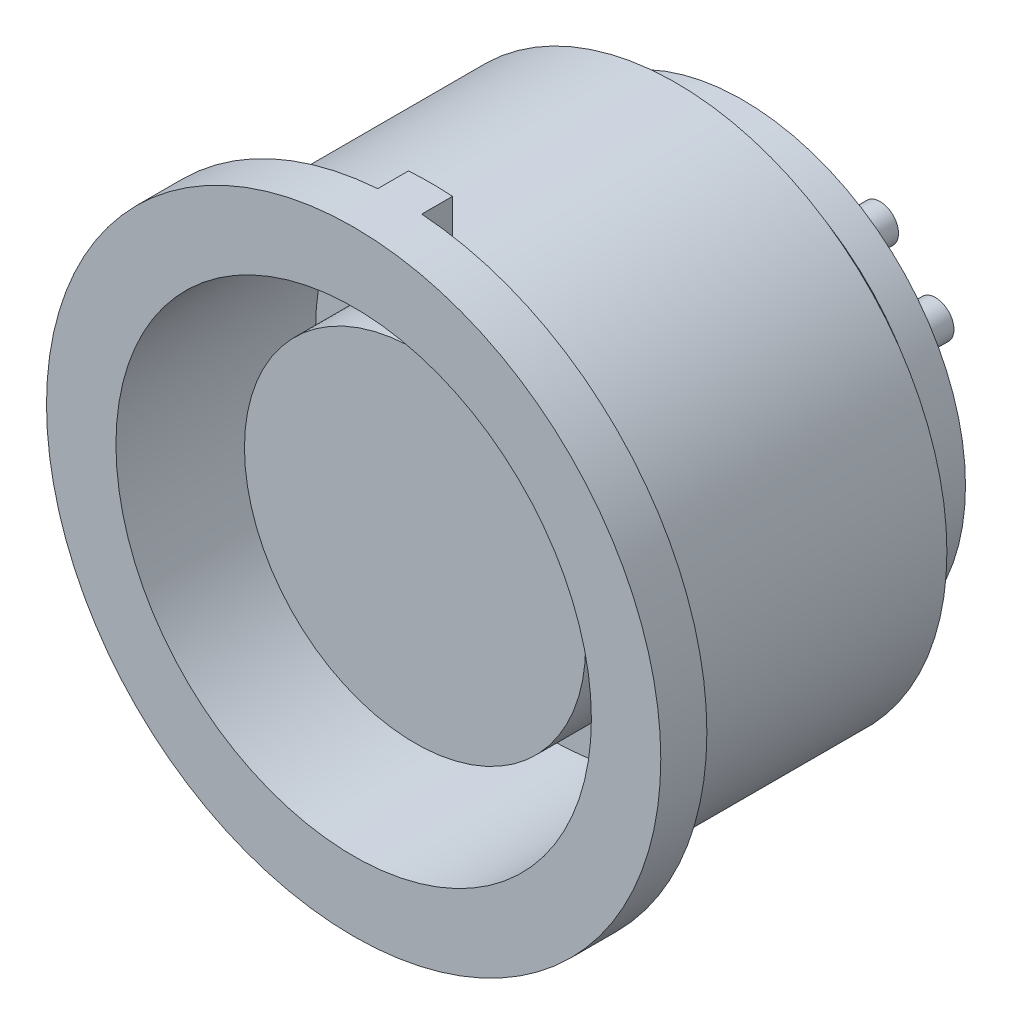
ISO-10303-21;
HEADER;
FILE_DESCRIPTION(('STEP AP214'),'2;1');
FILE_NAME('part.step','',(''),(''),'','','');
FILE_SCHEMA(('AUTOMOTIVE_DESIGN { 1 0 10303 214 1 1 1 1 }'));
ENDSEC;
DATA;
#1=APPLICATION_CONTEXT('core data for automotive mechanical design processes');
#2=APPLICATION_PROTOCOL_DEFINITION('international standard','automotive_design',2000,#1);
#3=PRODUCT_CONTEXT('',#1,'mechanical');
#4=PRODUCT('Part','Part','',(#3));
#5=PRODUCT_RELATED_PRODUCT_CATEGORY('part','',(#4));
#6=PRODUCT_DEFINITION_FORMATION('','',#4);
#7=PRODUCT_DEFINITION_CONTEXT('part definition',#1,'design');
#8=PRODUCT_DEFINITION('design','',#6,#7);
#9=PRODUCT_DEFINITION_SHAPE('','',#8);
#10=(LENGTH_UNIT() NAMED_UNIT(*) SI_UNIT(.MILLI.,.METRE.));
#11=(NAMED_UNIT(*) PLANE_ANGLE_UNIT() SI_UNIT($,.RADIAN.));
#12=(NAMED_UNIT(*) SI_UNIT($,.STERADIAN.) SOLID_ANGLE_UNIT());
#13=UNCERTAINTY_MEASURE_WITH_UNIT(LENGTH_MEASURE(1.E-05),#10,'distance_accuracy_value','');
#14=(GEOMETRIC_REPRESENTATION_CONTEXT(3) GLOBAL_UNCERTAINTY_ASSIGNED_CONTEXT((#13)) GLOBAL_UNIT_ASSIGNED_CONTEXT((#10,
#11,#12)) REPRESENTATION_CONTEXT('',''));
#15=CARTESIAN_POINT('',(0.,0.,0.));
#16=DIRECTION('',(0.,0.,1.));
#17=DIRECTION('',(1.,0.,0.));
#18=AXIS2_PLACEMENT_3D('',#15,#16,#17);
#19=CARTESIAN_POINT('',(0.,0.,11.3571428571429));
#20=DIRECTION('',(0.,0.,1.));
#21=DIRECTION('',(1.,0.,0.));
#22=AXIS2_PLACEMENT_3D('',#19,#20,#21);
#23=CYLINDRICAL_SURFACE('',#22,8.815);
#24=CARTESIAN_POINT('',(0.,0.,-9.));
#25=DIRECTION('',(0.,0.,1.));
#26=DIRECTION('',(1.,0.,0.));
#27=AXIS2_PLACEMENT_3D('',#24,#25,#26);
#28=CIRCLE('',#27,8.815);
#29=CARTESIAN_POINT('',(8.815,0.,-9.));
#30=VERTEX_POINT('',#29);
#31=EDGE_CURVE('E160',#30,#30,#28,.T.);
#32=ORIENTED_EDGE('',*,*,#31,.T.);
#33=EDGE_LOOP('',(#32));
#34=FACE_BOUND('',#33,.T.);
#35=DIRECTION('',(0.,0.,1.));
#36=VECTOR('',#35,1.);
#37=CARTESIAN_POINT('',(0.716714940094325,8.78581497043078,-1.));
#38=LINE('',#37,#36);
#39=CARTESIAN_POINT('',(0.716714940094325,8.78581497043078,-0.999999999999999));
#40=VERTEX_POINT('',#39);
#41=CARTESIAN_POINT('',(0.716714940094325,8.78581497043078,0.));
#42=VERTEX_POINT('',#41);
#43=EDGE_CURVE('E79',#40,#42,#38,.T.);
#44=ORIENTED_EDGE('',*,*,#43,.T.);
#45=CARTESIAN_POINT('',(0.,0.,0.));
#46=DIRECTION('',(0.,0.,1.));
#47=DIRECTION('',(1.,0.,0.));
#48=AXIS2_PLACEMENT_3D('',#45,#46,#47);
#49=CIRCLE('',#48,8.815);
#50=CARTESIAN_POINT('',(-0.716714940094318,8.78581497043078,0.));
#51=VERTEX_POINT('',#50);
#52=EDGE_CURVE('E135',#51,#42,#49,.T.);
#53=ORIENTED_EDGE('',*,*,#52,.F.);
#54=DIRECTION('',(0.,0.,1.));
#55=VECTOR('',#54,1.);
#56=CARTESIAN_POINT('',(-0.716714940094317,8.78581497043078,-1.));
#57=LINE('',#56,#55);
#58=CARTESIAN_POINT('',(-0.716714940094317,8.78581497043078,-0.999999999999999));
#59=VERTEX_POINT('',#58);
#60=EDGE_CURVE('E53',#59,#51,#57,.T.);
#61=ORIENTED_EDGE('',*,*,#60,.F.);
#62=CARTESIAN_POINT('',(0.,0.,-1.));
#63=DIRECTION('',(0.,0.,1.));
#64=DIRECTION('',(-1.,0.,0.));
#65=AXIS2_PLACEMENT_3D('',#62,#63,#64);
#66=CIRCLE('',#65,8.815);
#67=EDGE_CURVE('E48',#40,#59,#66,.T.);
#68=ORIENTED_EDGE('',*,*,#67,.F.);
#69=EDGE_LOOP('',(#44,#53,#61,#68));
#70=FACE_BOUND('',#69,.T.);
#71=ADVANCED_FACE('F34',(#34,#70),#23,.T.);
#72=CARTESIAN_POINT('',(0.,8.815,0.));
#73=DIRECTION('',(0.,0.,1.));
#74=DIRECTION('',(1.,0.,0.));
#75=AXIS2_PLACEMENT_3D('',#72,#73,#74);
#76=PLANE('',#75);
#77=DIRECTION('',(0.,-1.,0.));
#78=VECTOR('',#77,1.);
#79=CARTESIAN_POINT('',(0.716714940094325,9.97428291631261,0.));
#80=LINE('',#79,#78);
#81=CARTESIAN_POINT('',(0.716714940094325,9.97428291631261,0.));
#82=VERTEX_POINT('',#81);
#83=EDGE_CURVE('E244',#82,#42,#80,.T.);
#84=ORIENTED_EDGE('',*,*,#83,.F.);
#85=CARTESIAN_POINT('',(0.,0.,0.));
#86=DIRECTION('',(0.,0.,1.));
#87=DIRECTION('',(1.,0.,0.));
#88=AXIS2_PLACEMENT_3D('',#85,#86,#87);
#89=CIRCLE('',#88,10.);
#90=CARTESIAN_POINT('',(-0.716714940094318,9.97428291631261,0.));
#91=VERTEX_POINT('',#90);
#92=EDGE_CURVE('E94',#91,#82,#89,.T.);
#93=ORIENTED_EDGE('',*,*,#92,.F.);
#94=DIRECTION('',(0.,1.,0.));
#95=VECTOR('',#94,1.);
#96=CARTESIAN_POINT('',(-0.716714940094318,9.97428291631261,0.));
#97=LINE('',#96,#95);
#98=EDGE_CURVE('E90',#51,#91,#97,.T.);
#99=ORIENTED_EDGE('',*,*,#98,.F.);
#100=ORIENTED_EDGE('',*,*,#52,.T.);
#101=EDGE_LOOP('',(#84,#93,#99,#100));
#102=FACE_BOUND('',#101,.T.);
#103=ADVANCED_FACE('F233',(#102),#76,.F.);
#104=CARTESIAN_POINT('',(0.,0.,-10.1308491942857));
#105=DIRECTION('',(0.,0.,1.));
#106=DIRECTION('',(1.,0.,0.));
#107=AXIS2_PLACEMENT_3D('',#104,#105,#106);
#108=CONICAL_SURFACE('',#107,7.25,0.945071369421413);
#109=ORIENTED_EDGE('',*,*,#31,.F.);
#110=EDGE_LOOP('',(#109));
#111=FACE_BOUND('',#110,.T.);
#112=CARTESIAN_POINT('',(0.,0.,-10.1308491942857));
#113=DIRECTION('',(0.,0.,1.));
#114=DIRECTION('',(1.,0.,0.));
#115=AXIS2_PLACEMENT_3D('',#112,#113,#114);
#116=CIRCLE('',#115,7.25);
#117=CARTESIAN_POINT('',(7.25,0.,-10.1308491942857));
#118=VERTEX_POINT('',#117);
#119=EDGE_CURVE('E157',#118,#118,#116,.T.);
#120=ORIENTED_EDGE('',*,*,#119,.T.);
#121=EDGE_LOOP('',(#120));
#122=FACE_BOUND('',#121,.T.);
#123=ADVANCED_FACE('F227',(#111,#122),#108,.T.);
#124=CARTESIAN_POINT('',(0.,0.,11.3571428571429));
#125=DIRECTION('',(0.,0.,1.));
#126=DIRECTION('',(1.,0.,0.));
#127=AXIS2_PLACEMENT_3D('',#124,#125,#126);
#128=CYLINDRICAL_SURFACE('',#127,7.25);
#129=ORIENTED_EDGE('',*,*,#119,.F.);
#130=EDGE_LOOP('',(#129));
#131=FACE_BOUND('',#130,.T.);
#132=CARTESIAN_POINT('',(0.,0.,-11.17));
#133=DIRECTION('',(0.,0.,1.));
#134=DIRECTION('',(1.,0.,0.));
#135=AXIS2_PLACEMENT_3D('',#132,#133,#134);
#136=CIRCLE('',#135,7.25);
#137=CARTESIAN_POINT('',(7.25,0.,-11.17));
#138=VERTEX_POINT('',#137);
#139=EDGE_CURVE('E154',#138,#138,#136,.T.);
#140=ORIENTED_EDGE('',*,*,#139,.T.);
#141=EDGE_LOOP('',(#140));
#142=FACE_BOUND('',#141,.T.);
#143=ADVANCED_FACE('F201',(#131,#142),#128,.T.);
#144=CARTESIAN_POINT('',(0.,7.25,-11.17));
#145=DIRECTION('',(0.,0.,1.));
#146=DIRECTION('',(1.,0.,0.));
#147=AXIS2_PLACEMENT_3D('',#144,#145,#146);
#148=PLANE('',#147);
#149=CARTESIAN_POINT('',(-1.96859885170401,-3.52115951013585,-11.17));
#150=DIRECTION('',(0.,0.,1.));
#151=DIRECTION('',(1.,0.,0.));
#152=AXIS2_PLACEMENT_3D('',#149,#150,#151);
#153=CIRCLE('',#152,0.6);
#154=CARTESIAN_POINT('',(-1.36859885170401,-3.52115951013585,-11.17));
#155=VERTEX_POINT('',#154);
#156=EDGE_CURVE('E11',#155,#155,#153,.F.);
#157=ORIENTED_EDGE('',*,*,#156,.F.);
#158=EDGE_LOOP('',(#157));
#159=FACE_BOUND('',#158,.T.);
#160=CARTESIAN_POINT('',(-1.96859885170399,-1.71395453986632,-11.17));
#161=DIRECTION('',(0.,0.,1.));
#162=DIRECTION('',(1.,0.,0.));
#163=AXIS2_PLACEMENT_3D('',#160,#161,#162);
#164=CIRCLE('',#163,0.6);
#165=CARTESIAN_POINT('',(-1.36859885170399,-1.71395453986632,-11.17));
#166=VERTEX_POINT('',#165);
#167=EDGE_CURVE('E41',#166,#166,#164,.F.);
#168=ORIENTED_EDGE('',*,*,#167,.F.);
#169=EDGE_LOOP('',(#168));
#170=FACE_BOUND('',#169,.T.);
#171=CARTESIAN_POINT('',(-3.77369962281195,-1.7139545398663,-11.17));
#172=DIRECTION('',(0.,0.,1.));
#173=DIRECTION('',(1.,0.,0.));
#174=AXIS2_PLACEMENT_3D('',#171,#172,#173);
#175=CIRCLE('',#174,0.6);
#176=CARTESIAN_POINT('',(-3.17369962281195,-1.7139545398663,-11.17));
#177=VERTEX_POINT('',#176);
#178=EDGE_CURVE('E190',#177,#177,#175,.F.);
#179=ORIENTED_EDGE('',*,*,#178,.F.);
#180=EDGE_LOOP('',(#179));
#181=FACE_BOUND('',#180,.T.);
#182=CARTESIAN_POINT('',(3.52115951013587,-1.96859885170397,-11.17));
#183=DIRECTION('',(0.,0.,1.));
#184=DIRECTION('',(1.,0.,0.));
#185=AXIS2_PLACEMENT_3D('',#182,#183,#184);
#186=CIRCLE('',#185,0.6);
#187=CARTESIAN_POINT('',(4.12115951013587,-1.96859885170397,-11.17));
#188=VERTEX_POINT('',#187);
#189=EDGE_CURVE('E187',#188,#188,#186,.F.);
#190=ORIENTED_EDGE('',*,*,#189,.F.);
#191=EDGE_LOOP('',(#190));
#192=FACE_BOUND('',#191,.T.);
#193=CARTESIAN_POINT('',(1.71395453986634,-1.96859885170397,-11.17));
#194=DIRECTION('',(0.,0.,1.));
#195=DIRECTION('',(1.,0.,0.));
#196=AXIS2_PLACEMENT_3D('',#193,#194,#195);
#197=CIRCLE('',#196,0.6);
#198=CARTESIAN_POINT('',(2.31395453986634,-1.96859885170397,-11.17));
#199=VERTEX_POINT('',#198);
#200=EDGE_CURVE('E184',#199,#199,#197,.F.);
#201=ORIENTED_EDGE('',*,*,#200,.F.);
#202=EDGE_LOOP('',(#201));
#203=FACE_BOUND('',#202,.T.);
#204=CARTESIAN_POINT('',(1.71395453986634,-3.77369962281193,-11.17));
#205=DIRECTION('',(0.,0.,1.));
#206=DIRECTION('',(1.,0.,0.));
#207=AXIS2_PLACEMENT_3D('',#204,#205,#206);
#208=CIRCLE('',#207,0.6);
#209=CARTESIAN_POINT('',(2.31395453986634,-3.77369962281193,-11.17));
#210=VERTEX_POINT('',#209);
#211=EDGE_CURVE('E181',#210,#210,#208,.F.);
#212=ORIENTED_EDGE('',*,*,#211,.F.);
#213=EDGE_LOOP('',(#212));
#214=FACE_BOUND('',#213,.T.);
#215=CARTESIAN_POINT('',(1.96859885170399,3.52115951013587,-11.17));
#216=DIRECTION('',(0.,0.,1.));
#217=DIRECTION('',(1.,0.,0.));
#218=AXIS2_PLACEMENT_3D('',#215,#216,#217);
#219=CIRCLE('',#218,0.6);
#220=CARTESIAN_POINT('',(2.56859885170399,3.52115951013587,-11.17));
#221=VERTEX_POINT('',#220);
#222=EDGE_CURVE('E178',#221,#221,#219,.F.);
#223=ORIENTED_EDGE('',*,*,#222,.F.);
#224=EDGE_LOOP('',(#223));
#225=FACE_BOUND('',#224,.T.);
#226=CARTESIAN_POINT('',(1.96859885170398,1.71395453986633,-11.17));
#227=DIRECTION('',(0.,0.,1.));
#228=DIRECTION('',(1.,0.,0.));
#229=AXIS2_PLACEMENT_3D('',#226,#227,#228);
#230=CIRCLE('',#229,0.6);
#231=CARTESIAN_POINT('',(2.56859885170398,1.71395453986633,-11.17));
#232=VERTEX_POINT('',#231);
#233=EDGE_CURVE('E175',#232,#232,#230,.F.);
#234=ORIENTED_EDGE('',*,*,#233,.F.);
#235=EDGE_LOOP('',(#234));
#236=FACE_BOUND('',#235,.T.);
#237=CARTESIAN_POINT('',(3.77369962281194,1.71395453986632,-11.17));
#238=DIRECTION('',(0.,0.,1.));
#239=DIRECTION('',(1.,0.,0.));
#240=AXIS2_PLACEMENT_3D('',#237,#238,#239);
#241=CIRCLE('',#240,0.6);
#242=CARTESIAN_POINT('',(4.37369962281194,1.71395453986632,-11.17));
#243=VERTEX_POINT('',#242);
#244=EDGE_CURVE('E172',#243,#243,#241,.F.);
#245=ORIENTED_EDGE('',*,*,#244,.F.);
#246=EDGE_LOOP('',(#245));
#247=FACE_BOUND('',#246,.T.);
#248=CARTESIAN_POINT('',(-3.52115951013587,1.96859885170397,-11.17));
#249=DIRECTION('',(0.,0.,1.));
#250=DIRECTION('',(1.,0.,0.));
#251=AXIS2_PLACEMENT_3D('',#248,#249,#250);
#252=CIRCLE('',#251,0.6);
#253=CARTESIAN_POINT('',(-2.92115951013587,1.96859885170397,-11.17));
#254=VERTEX_POINT('',#253);
#255=EDGE_CURVE('E169',#254,#254,#252,.F.);
#256=ORIENTED_EDGE('',*,*,#255,.F.);
#257=EDGE_LOOP('',(#256));
#258=FACE_BOUND('',#257,.T.);
#259=CARTESIAN_POINT('',(-1.71395453986634,1.96859885170397,-11.17));
#260=DIRECTION('',(0.,0.,1.));
#261=DIRECTION('',(1.,0.,0.));
#262=AXIS2_PLACEMENT_3D('',#259,#260,#261);
#263=CIRCLE('',#262,0.6);
#264=CARTESIAN_POINT('',(-1.11395453986634,1.96859885170397,-11.17));
#265=VERTEX_POINT('',#264);
#266=EDGE_CURVE('E166',#265,#265,#263,.F.);
#267=ORIENTED_EDGE('',*,*,#266,.F.);
#268=EDGE_LOOP('',(#267));
#269=FACE_BOUND('',#268,.T.);
#270=CARTESIAN_POINT('',(-1.71395453986634,3.77369962281193,-11.17));
#271=DIRECTION('',(0.,0.,1.));
#272=DIRECTION('',(1.,0.,0.));
#273=AXIS2_PLACEMENT_3D('',#270,#271,#272);
#274=CIRCLE('',#273,0.6);
#275=CARTESIAN_POINT('',(-1.11395453986634,3.77369962281193,-11.17));
#276=VERTEX_POINT('',#275);
#277=EDGE_CURVE('E163',#276,#276,#274,.F.);
#278=ORIENTED_EDGE('',*,*,#277,.F.);
#279=EDGE_LOOP('',(#278));
#280=FACE_BOUND('',#279,.T.);
#281=ORIENTED_EDGE('',*,*,#139,.F.);
#282=EDGE_LOOP('',(#281));
#283=FACE_BOUND('',#282,.T.);
#284=ADVANCED_FACE('F197',(#159,#170,#181,#192,#203,#214,#225,#236,#247,#258,#269,#280,#283),
#148,.F.);
#285=CARTESIAN_POINT('',(0.,5.555,-0.5));
#286=DIRECTION('',(0.,0.,-1.));
#287=DIRECTION('',(-1.,0.,0.));
#288=AXIS2_PLACEMENT_3D('',#285,#286,#287);
#289=PLANE('',#288);
#290=CARTESIAN_POINT('',(0.,0.,-0.5));
#291=DIRECTION('',(0.,0.,1.));
#292=DIRECTION('',(1.,0.,0.));
#293=AXIS2_PLACEMENT_3D('',#290,#291,#292);
#294=CIRCLE('',#293,5.555);
#295=CARTESIAN_POINT('',(5.555,0.,-0.5));
#296=VERTEX_POINT('',#295);
#297=EDGE_CURVE('E151',#296,#296,#294,.T.);
#298=ORIENTED_EDGE('',*,*,#297,.T.);
#299=EDGE_LOOP('',(#298));
#300=FACE_BOUND('',#299,.T.);
#301=ADVANCED_FACE('F200',(#300),#289,.F.);
#302=CARTESIAN_POINT('',(0.,0.,11.3571428571429));
#303=DIRECTION('',(0.,0.,1.));
#304=DIRECTION('',(1.,0.,0.));
#305=AXIS2_PLACEMENT_3D('',#302,#303,#304);
#306=CYLINDRICAL_SURFACE('',#305,5.555);
#307=ORIENTED_EDGE('',*,*,#297,.F.);
#308=EDGE_LOOP('',(#307));
#309=FACE_BOUND('',#308,.T.);
#310=CARTESIAN_POINT('',(0.,0.,-5.));
#311=DIRECTION('',(0.,0.,1.));
#312=DIRECTION('',(1.,0.,0.));
#313=AXIS2_PLACEMENT_3D('',#310,#311,#312);
#314=CIRCLE('',#313,5.555);
#315=CARTESIAN_POINT('',(5.555,0.,-5.));
#316=VERTEX_POINT('',#315);
#317=EDGE_CURVE('E148',#316,#316,#314,.T.);
#318=ORIENTED_EDGE('',*,*,#317,.T.);
#319=EDGE_LOOP('',(#318));
#320=FACE_BOUND('',#319,.T.);
#321=ADVANCED_FACE('F372',(#309,#320),#306,.T.);
#322=CARTESIAN_POINT('',(0.,7.74,-5.));
#323=DIRECTION('',(0.,0.,-1.));
#324=DIRECTION('',(-1.,0.,0.));
#325=AXIS2_PLACEMENT_3D('',#322,#323,#324);
#326=PLANE('',#325);
#327=ORIENTED_EDGE('',*,*,#317,.F.);
#328=EDGE_LOOP('',(#327));
#329=FACE_BOUND('',#328,.T.);
#330=CARTESIAN_POINT('',(0.,0.,-5.));
#331=DIRECTION('',(0.,0.,1.));
#332=DIRECTION('',(1.,0.,0.));
#333=AXIS2_PLACEMENT_3D('',#330,#331,#332);
#334=CIRCLE('',#333,7.74);
#335=CARTESIAN_POINT('',(7.74,0.,-5.));
#336=VERTEX_POINT('',#335);
#337=EDGE_CURVE('E145',#336,#336,#334,.T.);
#338=ORIENTED_EDGE('',*,*,#337,.T.);
#339=EDGE_LOOP('',(#338));
#340=FACE_BOUND('',#339,.T.);
#341=ADVANCED_FACE('F368',(#329,#340),#326,.F.);
#342=CARTESIAN_POINT('',(0.,0.,11.3571428571429));
#343=DIRECTION('',(0.,0.,1.));
#344=DIRECTION('',(1.,0.,0.));
#345=AXIS2_PLACEMENT_3D('',#342,#343,#344);
#346=CYLINDRICAL_SURFACE('',#345,7.74);
#347=ORIENTED_EDGE('',*,*,#337,.F.);
#348=EDGE_LOOP('',(#347));
#349=FACE_BOUND('',#348,.T.);
#350=CARTESIAN_POINT('',(0.,0.,1.5));
#351=DIRECTION('',(0.,0.,1.));
#352=DIRECTION('',(1.,0.,0.));
#353=AXIS2_PLACEMENT_3D('',#350,#351,#352);
#354=CIRCLE('',#353,7.74);
#355=CARTESIAN_POINT('',(7.74,0.,1.5));
#356=VERTEX_POINT('',#355);
#357=EDGE_CURVE('E142',#356,#356,#354,.T.);
#358=ORIENTED_EDGE('',*,*,#357,.T.);
#359=EDGE_LOOP('',(#358));
#360=FACE_BOUND('',#359,.T.);
#361=ADVANCED_FACE('F364',(#349,#360),#346,.F.);
#362=CARTESIAN_POINT('',(0.,10.,1.5));
#363=DIRECTION('',(0.,0.,-1.));
#364=DIRECTION('',(-1.,0.,0.));
#365=AXIS2_PLACEMENT_3D('',#362,#363,#364);
#366=PLANE('',#365);
#367=ORIENTED_EDGE('',*,*,#357,.F.);
#368=EDGE_LOOP('',(#367));
#369=FACE_BOUND('',#368,.T.);
#370=CARTESIAN_POINT('',(0.,0.,1.5));
#371=DIRECTION('',(0.,0.,1.));
#372=DIRECTION('',(1.,0.,0.));
#373=AXIS2_PLACEMENT_3D('',#370,#371,#372);
#374=CIRCLE('',#373,10.);
#375=CARTESIAN_POINT('',(10.,0.,1.5));
#376=VERTEX_POINT('',#375);
#377=EDGE_CURVE('E139',#376,#376,#374,.T.);
#378=ORIENTED_EDGE('',*,*,#377,.T.);
#379=EDGE_LOOP('',(#378));
#380=FACE_BOUND('',#379,.T.);
#381=ADVANCED_FACE('F360',(#369,#380),#366,.F.);
#382=CARTESIAN_POINT('',(0.,0.,11.3571428571429));
#383=DIRECTION('',(0.,0.,1.));
#384=DIRECTION('',(1.,0.,0.));
#385=AXIS2_PLACEMENT_3D('',#382,#383,#384);
#386=CYLINDRICAL_SURFACE('',#385,10.);
#387=ORIENTED_EDGE('',*,*,#377,.F.);
#388=EDGE_LOOP('',(#387));
#389=FACE_BOUND('',#388,.T.);
#390=ORIENTED_EDGE('',*,*,#92,.T.);
#391=DIRECTION('',(0.,0.,1.));
#392=VECTOR('',#391,1.);
#393=CARTESIAN_POINT('',(0.716714940094325,9.97428291631261,-1.));
#394=LINE('',#393,#392);
#395=CARTESIAN_POINT('',(0.716714940094325,9.97428291631261,-1.));
#396=VERTEX_POINT('',#395);
#397=EDGE_CURVE('E78',#396,#82,#394,.T.);
#398=ORIENTED_EDGE('',*,*,#397,.F.);
#399=CARTESIAN_POINT('',(0.,0.,-1.));
#400=DIRECTION('',(0.,0.,-1.));
#401=DIRECTION('',(-1.,0.,0.));
#402=AXIS2_PLACEMENT_3D('',#399,#400,#401);
#403=CIRCLE('',#402,10.);
#404=CARTESIAN_POINT('',(-0.716714940094318,9.97428291631261,-1.));
#405=VERTEX_POINT('',#404);
#406=EDGE_CURVE('E81',#405,#396,#403,.T.);
#407=ORIENTED_EDGE('',*,*,#406,.F.);
#408=DIRECTION('',(0.,0.,1.));
#409=VECTOR('',#408,1.);
#410=CARTESIAN_POINT('',(-0.716714940094318,9.97428291631261,-1.));
#411=LINE('',#410,#409);
#412=EDGE_CURVE('E251',#405,#91,#411,.T.);
#413=ORIENTED_EDGE('',*,*,#412,.T.);
#414=EDGE_LOOP('',(#390,#398,#407,#413));
#415=FACE_BOUND('',#414,.T.);
#416=ADVANCED_FACE('F93',(#389,#415),#386,.T.);
#417=CARTESIAN_POINT('',(-1.71395453986634,3.77369962281193,-13.67));
#418=DIRECTION('',(0.,0.,1.));
#419=DIRECTION('',(1.,0.,0.));
#420=AXIS2_PLACEMENT_3D('',#417,#418,#419);
#421=CYLINDRICAL_SURFACE('',#420,0.6);
#422=CARTESIAN_POINT('',(-1.71395453986634,3.77369962281193,-13.67));
#423=DIRECTION('',(0.,0.,-1.));
#424=DIRECTION('',(-1.,0.,0.));
#425=AXIS2_PLACEMENT_3D('',#422,#423,#424);
#426=CIRCLE('',#425,0.6);
#427=CARTESIAN_POINT('',(-2.31395453986634,3.77369962281193,-13.67));
#428=VERTEX_POINT('',#427);
#429=EDGE_CURVE('E132',#428,#428,#426,.T.);
#430=ORIENTED_EDGE('',*,*,#429,.F.);
#431=EDGE_LOOP('',(#430));
#432=FACE_BOUND('',#431,.T.);
#433=ORIENTED_EDGE('',*,*,#277,.T.);
#434=EDGE_LOOP('',(#433));
#435=FACE_BOUND('',#434,.T.);
#436=ADVANCED_FACE('F353',(#432,#435),#421,.T.);
#437=CARTESIAN_POINT('',(-1.71395453986634,3.77369962281193,-13.67));
#438=DIRECTION('',(0.,0.,-1.));
#439=DIRECTION('',(-1.,0.,0.));
#440=AXIS2_PLACEMENT_3D('',#437,#438,#439);
#441=PLANE('',#440);
#442=ORIENTED_EDGE('',*,*,#429,.T.);
#443=EDGE_LOOP('',(#442));
#444=FACE_BOUND('',#443,.T.);
#445=ADVANCED_FACE('F349',(#444),#441,.T.);
#446=CARTESIAN_POINT('',(-1.71395453986634,1.96859885170397,-13.67));
#447=DIRECTION('',(0.,0.,1.));
#448=DIRECTION('',(1.,0.,0.));
#449=AXIS2_PLACEMENT_3D('',#446,#447,#448);
#450=CYLINDRICAL_SURFACE('',#449,0.6);
#451=CARTESIAN_POINT('',(-1.71395453986634,1.96859885170397,-13.67));
#452=DIRECTION('',(0.,0.,-1.));
#453=DIRECTION('',(-1.,0.,0.));
#454=AXIS2_PLACEMENT_3D('',#451,#452,#453);
#455=CIRCLE('',#454,0.6);
#456=CARTESIAN_POINT('',(-2.31395453986634,1.96859885170397,-13.67));
#457=VERTEX_POINT('',#456);
#458=EDGE_CURVE('E129',#457,#457,#455,.T.);
#459=ORIENTED_EDGE('',*,*,#458,.F.);
#460=EDGE_LOOP('',(#459));
#461=FACE_BOUND('',#460,.T.);
#462=ORIENTED_EDGE('',*,*,#266,.T.);
#463=EDGE_LOOP('',(#462));
#464=FACE_BOUND('',#463,.T.);
#465=ADVANCED_FACE('F345',(#461,#464),#450,.T.);
#466=CARTESIAN_POINT('',(-1.71395453986634,1.96859885170397,-13.67));
#467=DIRECTION('',(0.,0.,-1.));
#468=DIRECTION('',(-1.,0.,0.));
#469=AXIS2_PLACEMENT_3D('',#466,#467,#468);
#470=PLANE('',#469);
#471=ORIENTED_EDGE('',*,*,#458,.T.);
#472=EDGE_LOOP('',(#471));
#473=FACE_BOUND('',#472,.T.);
#474=ADVANCED_FACE('F341',(#473),#470,.T.);
#475=CARTESIAN_POINT('',(-3.52115951013587,1.96859885170397,-13.67));
#476=DIRECTION('',(0.,0.,1.));
#477=DIRECTION('',(1.,0.,0.));
#478=AXIS2_PLACEMENT_3D('',#475,#476,#477);
#479=CYLINDRICAL_SURFACE('',#478,0.6);
#480=CARTESIAN_POINT('',(-3.52115951013587,1.96859885170397,-13.67));
#481=DIRECTION('',(0.,0.,-1.));
#482=DIRECTION('',(-1.,0.,0.));
#483=AXIS2_PLACEMENT_3D('',#480,#481,#482);
#484=CIRCLE('',#483,0.6);
#485=CARTESIAN_POINT('',(-4.12115951013587,1.96859885170397,-13.67));
#486=VERTEX_POINT('',#485);
#487=EDGE_CURVE('E126',#486,#486,#484,.T.);
#488=ORIENTED_EDGE('',*,*,#487,.F.);
#489=EDGE_LOOP('',(#488));
#490=FACE_BOUND('',#489,.T.);
#491=ORIENTED_EDGE('',*,*,#255,.T.);
#492=EDGE_LOOP('',(#491));
#493=FACE_BOUND('',#492,.T.);
#494=ADVANCED_FACE('F337',(#490,#493),#479,.T.);
#495=CARTESIAN_POINT('',(-3.52115951013587,1.96859885170397,-13.67));
#496=DIRECTION('',(0.,0.,-1.));
#497=DIRECTION('',(-1.,0.,0.));
#498=AXIS2_PLACEMENT_3D('',#495,#496,#497);
#499=PLANE('',#498);
#500=ORIENTED_EDGE('',*,*,#487,.T.);
#501=EDGE_LOOP('',(#500));
#502=FACE_BOUND('',#501,.T.);
#503=ADVANCED_FACE('F333',(#502),#499,.T.);
#504=CARTESIAN_POINT('',(3.77369962281194,1.71395453986632,-13.67));
#505=DIRECTION('',(0.,0.,1.));
#506=DIRECTION('',(1.,0.,0.));
#507=AXIS2_PLACEMENT_3D('',#504,#505,#506);
#508=CYLINDRICAL_SURFACE('',#507,0.6);
#509=CARTESIAN_POINT('',(3.77369962281194,1.71395453986632,-13.67));
#510=DIRECTION('',(0.,0.,-1.));
#511=DIRECTION('',(0.,1.,0.));
#512=AXIS2_PLACEMENT_3D('',#509,#510,#511);
#513=CIRCLE('',#512,0.6);
#514=CARTESIAN_POINT('',(3.77369962281194,2.31395453986632,-13.67));
#515=VERTEX_POINT('',#514);
#516=EDGE_CURVE('E123',#515,#515,#513,.T.);
#517=ORIENTED_EDGE('',*,*,#516,.F.);
#518=EDGE_LOOP('',(#517));
#519=FACE_BOUND('',#518,.T.);
#520=ORIENTED_EDGE('',*,*,#244,.T.);
#521=EDGE_LOOP('',(#520));
#522=FACE_BOUND('',#521,.T.);
#523=ADVANCED_FACE('F329',(#519,#522),#508,.T.);
#524=CARTESIAN_POINT('',(3.77369962281194,1.71395453986632,-13.67));
#525=DIRECTION('',(0.,0.,-1.));
#526=DIRECTION('',(0.,1.,0.));
#527=AXIS2_PLACEMENT_3D('',#524,#525,#526);
#528=PLANE('',#527);
#529=ORIENTED_EDGE('',*,*,#516,.T.);
#530=EDGE_LOOP('',(#529));
#531=FACE_BOUND('',#530,.T.);
#532=ADVANCED_FACE('F325',(#531),#528,.T.);
#533=CARTESIAN_POINT('',(1.96859885170398,1.71395453986633,-13.67));
#534=DIRECTION('',(0.,0.,1.));
#535=DIRECTION('',(1.,0.,0.));
#536=AXIS2_PLACEMENT_3D('',#533,#534,#535);
#537=CYLINDRICAL_SURFACE('',#536,0.6);
#538=CARTESIAN_POINT('',(1.96859885170398,1.71395453986633,-13.67));
#539=DIRECTION('',(0.,0.,-1.));
#540=DIRECTION('',(0.,1.,0.));
#541=AXIS2_PLACEMENT_3D('',#538,#539,#540);
#542=CIRCLE('',#541,0.6);
#543=CARTESIAN_POINT('',(1.96859885170398,2.31395453986633,-13.67));
#544=VERTEX_POINT('',#543);
#545=EDGE_CURVE('E120',#544,#544,#542,.T.);
#546=ORIENTED_EDGE('',*,*,#545,.F.);
#547=EDGE_LOOP('',(#546));
#548=FACE_BOUND('',#547,.T.);
#549=ORIENTED_EDGE('',*,*,#233,.T.);
#550=EDGE_LOOP('',(#549));
#551=FACE_BOUND('',#550,.T.);
#552=ADVANCED_FACE('F321',(#548,#551),#537,.T.);
#553=CARTESIAN_POINT('',(1.96859885170398,1.71395453986633,-13.67));
#554=DIRECTION('',(0.,0.,-1.));
#555=DIRECTION('',(0.,1.,0.));
#556=AXIS2_PLACEMENT_3D('',#553,#554,#555);
#557=PLANE('',#556);
#558=ORIENTED_EDGE('',*,*,#545,.T.);
#559=EDGE_LOOP('',(#558));
#560=FACE_BOUND('',#559,.T.);
#561=ADVANCED_FACE('F317',(#560),#557,.T.);
#562=CARTESIAN_POINT('',(1.96859885170399,3.52115951013587,-13.67));
#563=DIRECTION('',(0.,0.,1.));
#564=DIRECTION('',(1.,0.,0.));
#565=AXIS2_PLACEMENT_3D('',#562,#563,#564);
#566=CYLINDRICAL_SURFACE('',#565,0.6);
#567=CARTESIAN_POINT('',(1.96859885170399,3.52115951013587,-13.67));
#568=DIRECTION('',(0.,0.,-1.));
#569=DIRECTION('',(0.,1.,0.));
#570=AXIS2_PLACEMENT_3D('',#567,#568,#569);
#571=CIRCLE('',#570,0.6);
#572=CARTESIAN_POINT('',(1.96859885170399,4.12115951013587,-13.67));
#573=VERTEX_POINT('',#572);
#574=EDGE_CURVE('E117',#573,#573,#571,.T.);
#575=ORIENTED_EDGE('',*,*,#574,.F.);
#576=EDGE_LOOP('',(#575));
#577=FACE_BOUND('',#576,.T.);
#578=ORIENTED_EDGE('',*,*,#222,.T.);
#579=EDGE_LOOP('',(#578));
#580=FACE_BOUND('',#579,.T.);
#581=ADVANCED_FACE('F313',(#577,#580),#566,.T.);
#582=CARTESIAN_POINT('',(1.96859885170399,3.52115951013587,-13.67));
#583=DIRECTION('',(0.,0.,-1.));
#584=DIRECTION('',(0.,1.,0.));
#585=AXIS2_PLACEMENT_3D('',#582,#583,#584);
#586=PLANE('',#585);
#587=ORIENTED_EDGE('',*,*,#574,.T.);
#588=EDGE_LOOP('',(#587));
#589=FACE_BOUND('',#588,.T.);
#590=ADVANCED_FACE('F309',(#589),#586,.T.);
#591=CARTESIAN_POINT('',(1.71395453986634,-3.77369962281193,-13.67));
#592=DIRECTION('',(0.,0.,1.));
#593=DIRECTION('',(1.,0.,0.));
#594=AXIS2_PLACEMENT_3D('',#591,#592,#593);
#595=CYLINDRICAL_SURFACE('',#594,0.6);
#596=CARTESIAN_POINT('',(1.71395453986634,-3.77369962281193,-13.67));
#597=DIRECTION('',(0.,0.,-1.));
#598=DIRECTION('',(1.,0.,0.));
#599=AXIS2_PLACEMENT_3D('',#596,#597,#598);
#600=CIRCLE('',#599,0.6);
#601=CARTESIAN_POINT('',(2.31395453986634,-3.77369962281193,-13.67));
#602=VERTEX_POINT('',#601);
#603=EDGE_CURVE('E114',#602,#602,#600,.T.);
#604=ORIENTED_EDGE('',*,*,#603,.F.);
#605=EDGE_LOOP('',(#604));
#606=FACE_BOUND('',#605,.T.);
#607=ORIENTED_EDGE('',*,*,#211,.T.);
#608=EDGE_LOOP('',(#607));
#609=FACE_BOUND('',#608,.T.);
#610=ADVANCED_FACE('F305',(#606,#609),#595,.T.);
#611=CARTESIAN_POINT('',(1.71395453986634,-3.77369962281193,-13.67));
#612=DIRECTION('',(0.,0.,-1.));
#613=DIRECTION('',(1.,0.,0.));
#614=AXIS2_PLACEMENT_3D('',#611,#612,#613);
#615=PLANE('',#614);
#616=ORIENTED_EDGE('',*,*,#603,.T.);
#617=EDGE_LOOP('',(#616));
#618=FACE_BOUND('',#617,.T.);
#619=ADVANCED_FACE('F301',(#618),#615,.T.);
#620=CARTESIAN_POINT('',(1.71395453986634,-1.96859885170397,-13.67));
#621=DIRECTION('',(0.,0.,1.));
#622=DIRECTION('',(1.,0.,0.));
#623=AXIS2_PLACEMENT_3D('',#620,#621,#622);
#624=CYLINDRICAL_SURFACE('',#623,0.6);
#625=CARTESIAN_POINT('',(1.71395453986634,-1.96859885170397,-13.67));
#626=DIRECTION('',(0.,0.,-1.));
#627=DIRECTION('',(1.,0.,0.));
#628=AXIS2_PLACEMENT_3D('',#625,#626,#627);
#629=CIRCLE('',#628,0.6);
#630=CARTESIAN_POINT('',(2.31395453986634,-1.96859885170397,-13.67));
#631=VERTEX_POINT('',#630);
#632=EDGE_CURVE('E111',#631,#631,#629,.T.);
#633=ORIENTED_EDGE('',*,*,#632,.F.);
#634=EDGE_LOOP('',(#633));
#635=FACE_BOUND('',#634,.T.);
#636=ORIENTED_EDGE('',*,*,#200,.T.);
#637=EDGE_LOOP('',(#636));
#638=FACE_BOUND('',#637,.T.);
#639=ADVANCED_FACE('F297',(#635,#638),#624,.T.);
#640=CARTESIAN_POINT('',(1.71395453986634,-1.96859885170397,-13.67));
#641=DIRECTION('',(0.,0.,-1.));
#642=DIRECTION('',(1.,0.,0.));
#643=AXIS2_PLACEMENT_3D('',#640,#641,#642);
#644=PLANE('',#643);
#645=ORIENTED_EDGE('',*,*,#632,.T.);
#646=EDGE_LOOP('',(#645));
#647=FACE_BOUND('',#646,.T.);
#648=ADVANCED_FACE('F293',(#647),#644,.T.);
#649=CARTESIAN_POINT('',(3.52115951013587,-1.96859885170397,-13.67));
#650=DIRECTION('',(0.,0.,1.));
#651=DIRECTION('',(1.,0.,0.));
#652=AXIS2_PLACEMENT_3D('',#649,#650,#651);
#653=CYLINDRICAL_SURFACE('',#652,0.6);
#654=CARTESIAN_POINT('',(3.52115951013587,-1.96859885170397,-13.67));
#655=DIRECTION('',(0.,0.,-1.));
#656=DIRECTION('',(1.,0.,0.));
#657=AXIS2_PLACEMENT_3D('',#654,#655,#656);
#658=CIRCLE('',#657,0.6);
#659=CARTESIAN_POINT('',(4.12115951013587,-1.96859885170397,-13.67));
#660=VERTEX_POINT('',#659);
#661=EDGE_CURVE('E108',#660,#660,#658,.T.);
#662=ORIENTED_EDGE('',*,*,#661,.F.);
#663=EDGE_LOOP('',(#662));
#664=FACE_BOUND('',#663,.T.);
#665=ORIENTED_EDGE('',*,*,#189,.T.);
#666=EDGE_LOOP('',(#665));
#667=FACE_BOUND('',#666,.T.);
#668=ADVANCED_FACE('F289',(#664,#667),#653,.T.);
#669=CARTESIAN_POINT('',(3.52115951013587,-1.96859885170397,-13.67));
#670=DIRECTION('',(0.,0.,-1.));
#671=DIRECTION('',(1.,0.,0.));
#672=AXIS2_PLACEMENT_3D('',#669,#670,#671);
#673=PLANE('',#672);
#674=ORIENTED_EDGE('',*,*,#661,.T.);
#675=EDGE_LOOP('',(#674));
#676=FACE_BOUND('',#675,.T.);
#677=ADVANCED_FACE('F285',(#676),#673,.T.);
#678=CARTESIAN_POINT('',(-3.77369962281195,-1.7139545398663,-13.67));
#679=DIRECTION('',(0.,0.,1.));
#680=DIRECTION('',(1.,0.,0.));
#681=AXIS2_PLACEMENT_3D('',#678,#679,#680);
#682=CYLINDRICAL_SURFACE('',#681,0.6);
#683=CARTESIAN_POINT('',(-3.77369962281195,-1.7139545398663,-13.67));
#684=DIRECTION('',(0.,0.,-1.));
#685=DIRECTION('',(0.,-1.,0.));
#686=AXIS2_PLACEMENT_3D('',#683,#684,#685);
#687=CIRCLE('',#686,0.6);
#688=CARTESIAN_POINT('',(-3.77369962281196,-2.3139545398663,-13.67));
#689=VERTEX_POINT('',#688);
#690=EDGE_CURVE('E105',#689,#689,#687,.T.);
#691=ORIENTED_EDGE('',*,*,#690,.F.);
#692=EDGE_LOOP('',(#691));
#693=FACE_BOUND('',#692,.T.);
#694=ORIENTED_EDGE('',*,*,#178,.T.);
#695=EDGE_LOOP('',(#694));
#696=FACE_BOUND('',#695,.T.);
#697=ADVANCED_FACE('F281',(#693,#696),#682,.T.);
#698=CARTESIAN_POINT('',(-3.77369962281195,-1.7139545398663,-13.67));
#699=DIRECTION('',(0.,0.,-1.));
#700=DIRECTION('',(0.,-1.,0.));
#701=AXIS2_PLACEMENT_3D('',#698,#699,#700);
#702=PLANE('',#701);
#703=ORIENTED_EDGE('',*,*,#690,.T.);
#704=EDGE_LOOP('',(#703));
#705=FACE_BOUND('',#704,.T.);
#706=ADVANCED_FACE('F277',(#705),#702,.T.);
#707=CARTESIAN_POINT('',(-1.96859885170399,-1.71395453986632,-13.67));
#708=DIRECTION('',(0.,0.,1.));
#709=DIRECTION('',(1.,0.,0.));
#710=AXIS2_PLACEMENT_3D('',#707,#708,#709);
#711=CYLINDRICAL_SURFACE('',#710,0.6);
#712=CARTESIAN_POINT('',(-1.96859885170399,-1.71395453986632,-13.67));
#713=DIRECTION('',(0.,0.,-1.));
#714=DIRECTION('',(0.,-1.,0.));
#715=AXIS2_PLACEMENT_3D('',#712,#713,#714);
#716=CIRCLE('',#715,0.6);
#717=CARTESIAN_POINT('',(-1.968598851704,-2.31395453986632,-13.67));
#718=VERTEX_POINT('',#717);
#719=EDGE_CURVE('E98',#718,#718,#716,.T.);
#720=ORIENTED_EDGE('',*,*,#719,.F.);
#721=EDGE_LOOP('',(#720));
#722=FACE_BOUND('',#721,.T.);
#723=ORIENTED_EDGE('',*,*,#167,.T.);
#724=EDGE_LOOP('',(#723));
#725=FACE_BOUND('',#724,.T.);
#726=ADVANCED_FACE('F195',(#722,#725),#711,.T.);
#727=CARTESIAN_POINT('',(-1.96859885170399,-1.71395453986632,-13.67));
#728=DIRECTION('',(0.,0.,-1.));
#729=DIRECTION('',(0.,-1.,0.));
#730=AXIS2_PLACEMENT_3D('',#727,#728,#729);
#731=PLANE('',#730);
#732=ORIENTED_EDGE('',*,*,#719,.T.);
#733=EDGE_LOOP('',(#732));
#734=FACE_BOUND('',#733,.T.);
#735=ADVANCED_FACE('F270',(#734),#731,.T.);
#736=CARTESIAN_POINT('',(-1.96859885170401,-3.52115951013585,-13.67));
#737=DIRECTION('',(0.,0.,1.));
#738=DIRECTION('',(1.,0.,0.));
#739=AXIS2_PLACEMENT_3D('',#736,#737,#738);
#740=CYLINDRICAL_SURFACE('',#739,0.6);
#741=CARTESIAN_POINT('',(-1.96859885170401,-3.52115951013585,-13.67));
#742=DIRECTION('',(0.,0.,-1.));
#743=DIRECTION('',(0.,-1.,0.));
#744=AXIS2_PLACEMENT_3D('',#741,#742,#743);
#745=CIRCLE('',#744,0.6);
#746=CARTESIAN_POINT('',(-1.96859885170402,-4.12115951013585,-13.67));
#747=VERTEX_POINT('',#746);
#748=EDGE_CURVE('E95',#747,#747,#745,.T.);
#749=ORIENTED_EDGE('',*,*,#748,.F.);
#750=EDGE_LOOP('',(#749));
#751=FACE_BOUND('',#750,.T.);
#752=ORIENTED_EDGE('',*,*,#156,.T.);
#753=EDGE_LOOP('',(#752));
#754=FACE_BOUND('',#753,.T.);
#755=ADVANCED_FACE('F266',(#751,#754),#740,.T.);
#756=CARTESIAN_POINT('',(-1.96859885170401,-3.52115951013585,-13.67));
#757=DIRECTION('',(0.,0.,-1.));
#758=DIRECTION('',(0.,-1.,0.));
#759=AXIS2_PLACEMENT_3D('',#756,#757,#758);
#760=PLANE('',#759);
#761=ORIENTED_EDGE('',*,*,#748,.T.);
#762=EDGE_LOOP('',(#761));
#763=FACE_BOUND('',#762,.T.);
#764=ADVANCED_FACE('F261',(#763),#760,.T.);
#765=CARTESIAN_POINT('',(0.716714940094325,9.97428291631261,-1.));
#766=DIRECTION('',(-1.,0.,0.));
#767=DIRECTION('',(0.,0.,1.));
#768=AXIS2_PLACEMENT_3D('',#765,#766,#767);
#769=PLANE('',#768);
#770=ORIENTED_EDGE('',*,*,#83,.T.);
#771=ORIENTED_EDGE('',*,*,#43,.F.);
#772=DIRECTION('',(0.,-1.,0.));
#773=VECTOR('',#772,1.);
#774=CARTESIAN_POINT('',(0.716714940094325,9.97428291631261,-1.));
#775=LINE('',#774,#773);
#776=EDGE_CURVE('E73',#396,#40,#775,.T.);
#777=ORIENTED_EDGE('',*,*,#776,.F.);
#778=ORIENTED_EDGE('',*,*,#397,.T.);
#779=EDGE_LOOP('',(#770,#771,#777,#778));
#780=FACE_BOUND('',#779,.T.);
#781=ADVANCED_FACE('F76',(#780),#769,.F.);
#782=CARTESIAN_POINT('',(-0.716714940094318,9.97428291631261,-1.));
#783=DIRECTION('',(1.,0.,0.));
#784=DIRECTION('',(0.,1.,0.));
#785=AXIS2_PLACEMENT_3D('',#782,#783,#784);
#786=PLANE('',#785);
#787=ORIENTED_EDGE('',*,*,#98,.T.);
#788=ORIENTED_EDGE('',*,*,#412,.F.);
#789=DIRECTION('',(0.,1.,0.));
#790=VECTOR('',#789,1.);
#791=CARTESIAN_POINT('',(-0.716714940094318,9.97428291631261,-1.));
#792=LINE('',#791,#790);
#793=EDGE_CURVE('E86',#59,#405,#792,.T.);
#794=ORIENTED_EDGE('',*,*,#793,.F.);
#795=ORIENTED_EDGE('',*,*,#60,.T.);
#796=EDGE_LOOP('',(#787,#788,#794,#795));
#797=FACE_BOUND('',#796,.T.);
#798=ADVANCED_FACE('F253',(#797),#786,.F.);
#799=CARTESIAN_POINT('',(0.,0.,-1.));
#800=DIRECTION('',(0.,0.,-1.));
#801=DIRECTION('',(-1.,0.,0.));
#802=AXIS2_PLACEMENT_3D('',#799,#800,#801);
#803=PLANE('',#802);
#804=ORIENTED_EDGE('',*,*,#406,.T.);
#805=ORIENTED_EDGE('',*,*,#776,.T.);
#806=ORIENTED_EDGE('',*,*,#67,.T.);
#807=ORIENTED_EDGE('',*,*,#793,.T.);
#808=EDGE_LOOP('',(#804,#805,#806,#807));
#809=FACE_BOUND('',#808,.T.);
#810=ADVANCED_FACE('F84',(#809),#803,.T.);
#811=CLOSED_SHELL('',(#71,#103,#123,#143,#284,#301,#321,#341,#361,#381,#416,#436,#445,#465,#474,
#494,#503,#523,#532,#552,#561,#581,#590,#610,#619,#639,#648,#668,#677,#697,#706,#726,#735,#755,
#764,#781,#798,#810));
#812=MANIFOLD_SOLID_BREP('B2',#811);
#813=ADVANCED_BREP_SHAPE_REPRESENTATION('',(#18,#812),#14);
#814=SHAPE_DEFINITION_REPRESENTATION(#9,#813);
ENDSEC;
END-ISO-10303-21;
